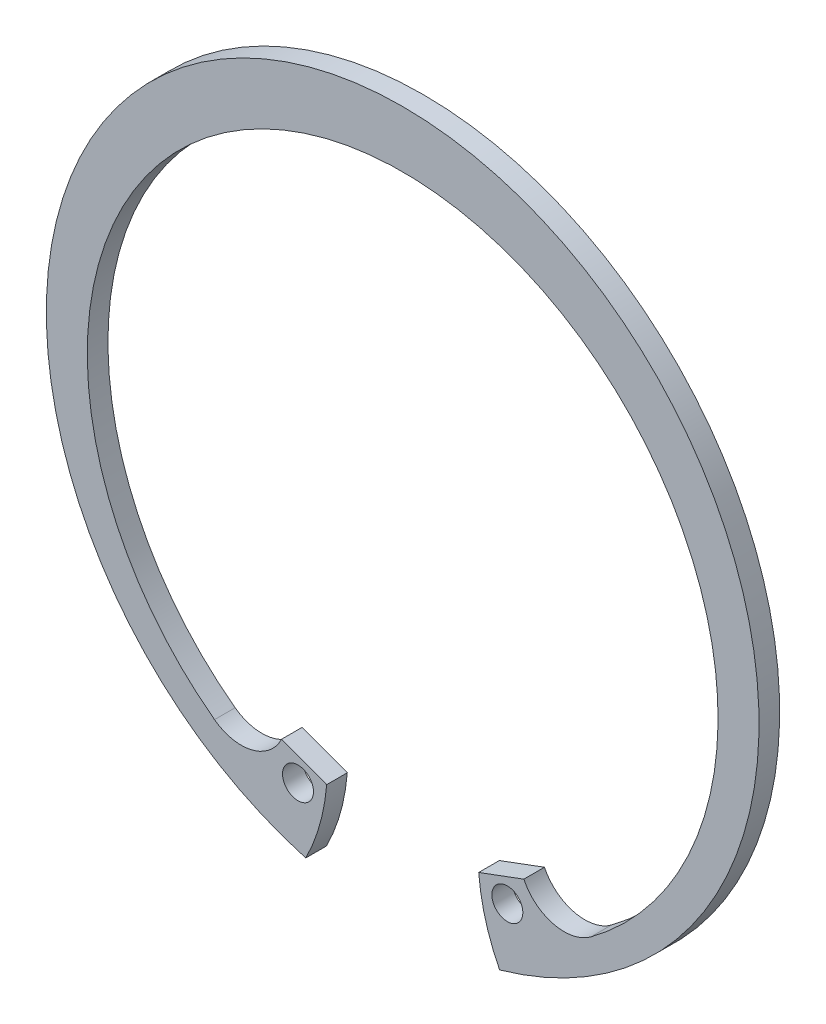
ISO-10303-21;
HEADER;
FILE_DESCRIPTION(('STEP AP214'),'2;1');
FILE_NAME('part.step','',(''),(''),'','','');
FILE_SCHEMA(('AUTOMOTIVE_DESIGN { 1 0 10303 214 1 1 1 1 }'));
ENDSEC;
DATA;
#1=APPLICATION_CONTEXT('core data for automotive mechanical design processes');
#2=APPLICATION_PROTOCOL_DEFINITION('international standard','automotive_design',2000,#1);
#3=PRODUCT_CONTEXT('',#1,'mechanical');
#4=PRODUCT('Part','Part','',(#3));
#5=PRODUCT_RELATED_PRODUCT_CATEGORY('part','',(#4));
#6=PRODUCT_DEFINITION_FORMATION('','',#4);
#7=PRODUCT_DEFINITION_CONTEXT('part definition',#1,'design');
#8=PRODUCT_DEFINITION('design','',#6,#7);
#9=PRODUCT_DEFINITION_SHAPE('','',#8);
#10=(LENGTH_UNIT() NAMED_UNIT(*) SI_UNIT(.MILLI.,.METRE.));
#11=(NAMED_UNIT(*) PLANE_ANGLE_UNIT() SI_UNIT($,.RADIAN.));
#12=(NAMED_UNIT(*) SI_UNIT($,.STERADIAN.) SOLID_ANGLE_UNIT());
#13=UNCERTAINTY_MEASURE_WITH_UNIT(LENGTH_MEASURE(1.E-05),#10,'distance_accuracy_value','');
#14=(GEOMETRIC_REPRESENTATION_CONTEXT(3) GLOBAL_UNCERTAINTY_ASSIGNED_CONTEXT((#13)) GLOBAL_UNIT_ASSIGNED_CONTEXT((#10,
#11,#12)) REPRESENTATION_CONTEXT('',''));
#15=CARTESIAN_POINT('',(0.,0.,0.));
#16=DIRECTION('',(0.,0.,1.));
#17=DIRECTION('',(1.,0.,0.));
#18=AXIS2_PLACEMENT_3D('',#15,#16,#17);
#19=CARTESIAN_POINT('',(0.,0.,-0.787399999999996));
#20=DIRECTION('',(0.,0.,1.));
#21=DIRECTION('',(1.,0.,0.));
#22=AXIS2_PLACEMENT_3D('',#19,#20,#21);
#23=CYLINDRICAL_SURFACE('',#22,27.1907);
#24=CARTESIAN_POINT('',(0.,0.,0.787400000000003));
#25=DIRECTION('',(0.,0.,1.));
#26=DIRECTION('',(-1.,0.,0.));
#27=AXIS2_PLACEMENT_3D('',#24,#25,#26);
#28=CIRCLE('',#27,27.1907);
#29=CARTESIAN_POINT('',(7.39561489525542,-26.1656080917504,0.787400000000003));
#30=VERTEX_POINT('',#29);
#31=CARTESIAN_POINT('',(-7.39561489525542,-26.1656080917504,0.787400000000003));
#32=VERTEX_POINT('',#31);
#33=EDGE_CURVE('E159',#30,#32,#28,.T.);
#34=ORIENTED_EDGE('',*,*,#33,.F.);
#35=DIRECTION('',(0.,0.,1.));
#36=VECTOR('',#35,1.);
#37=CARTESIAN_POINT('',(7.39561489525542,-26.1656080917504,-0.787399999999996));
#38=LINE('',#37,#36);
#39=CARTESIAN_POINT('',(7.39561489525542,-26.1656080917504,-0.787399999999996));
#40=VERTEX_POINT('',#39);
#41=EDGE_CURVE('E99',#40,#30,#38,.T.);
#42=ORIENTED_EDGE('',*,*,#41,.F.);
#43=CARTESIAN_POINT('',(0.,0.,-0.787399999999996));
#44=DIRECTION('',(0.,0.,1.));
#45=DIRECTION('',(-1.,0.,0.));
#46=AXIS2_PLACEMENT_3D('',#43,#44,#45);
#47=CIRCLE('',#46,27.1907);
#48=CARTESIAN_POINT('',(-7.39561489525542,-26.1656080917504,-0.787399999999996));
#49=VERTEX_POINT('',#48);
#50=EDGE_CURVE('E123',#40,#49,#47,.T.);
#51=ORIENTED_EDGE('',*,*,#50,.T.);
#52=DIRECTION('',(0.,0.,1.));
#53=VECTOR('',#52,1.);
#54=CARTESIAN_POINT('',(-7.39561489525542,-26.1656080917504,-0.787399999999996));
#55=LINE('',#54,#53);
#56=EDGE_CURVE('E170',#49,#32,#55,.T.);
#57=ORIENTED_EDGE('',*,*,#56,.T.);
#58=EDGE_LOOP('',(#34,#42,#51,#57));
#59=FACE_BOUND('',#58,.T.);
#60=ADVANCED_FACE('F32',(#59),#23,.T.);
#61=CARTESIAN_POINT('',(5.56259999999999,-20.6112705316776,-0.787399999999996));
#62=DIRECTION('',(-0.348262046442481,0.937397219436721,0.));
#63=DIRECTION('',(-0.937397219436721,-0.348262046442481,0.));
#64=AXIS2_PLACEMENT_3D('',#61,#62,#63);
#65=PLANE('',#64);
#66=DIRECTION('',(-0.93739721943672,-0.348262046442481,0.));
#67=VECTOR('',#66,1.);
#68=CARTESIAN_POINT('',(5.56259999999999,-20.6112705316776,-0.787399999999996));
#69=LINE('',#68,#67);
#70=CARTESIAN_POINT('',(9.24424160711762,-19.2434661326705,-0.787399999999996));
#71=VERTEX_POINT('',#70);
#72=CARTESIAN_POINT('',(5.80069889373692,-20.5228119718812,-0.787399999999996));
#73=VERTEX_POINT('',#72);
#74=EDGE_CURVE('E104',#71,#73,#69,.T.);
#75=ORIENTED_EDGE('',*,*,#74,.T.);
#76=DIRECTION('',(0.,0.,1.));
#77=VECTOR('',#76,1.);
#78=CARTESIAN_POINT('',(5.80069889373692,-20.5228119718812,-0.787399999999996));
#79=LINE('',#78,#77);
#80=CARTESIAN_POINT('',(5.80069889373692,-20.5228119718812,0.787400000000003));
#81=VERTEX_POINT('',#80);
#82=EDGE_CURVE('E97',#73,#81,#79,.T.);
#83=ORIENTED_EDGE('',*,*,#82,.T.);
#84=DIRECTION('',(-0.93739721943672,-0.348262046442481,0.));
#85=VECTOR('',#84,1.);
#86=CARTESIAN_POINT('',(5.56259999999999,-20.6112705316776,0.787400000000003));
#87=LINE('',#86,#85);
#88=CARTESIAN_POINT('',(9.24424160711762,-19.2434661326705,0.787400000000003));
#89=VERTEX_POINT('',#88);
#90=EDGE_CURVE('E103',#89,#81,#87,.T.);
#91=ORIENTED_EDGE('',*,*,#90,.F.);
#92=DIRECTION('',(0.,0.,1.));
#93=VECTOR('',#92,1.);
#94=CARTESIAN_POINT('',(9.24424160711762,-19.2434661326705,-0.787399999999996));
#95=LINE('',#94,#93);
#96=EDGE_CURVE('E53',#71,#89,#95,.T.);
#97=ORIENTED_EDGE('',*,*,#96,.F.);
#98=EDGE_LOOP('',(#75,#83,#91,#97));
#99=FACE_BOUND('',#98,.T.);
#100=ADVANCED_FACE('F102',(#99),#65,.T.);
#101=CARTESIAN_POINT('',(0.,0.,-0.787399999999996));
#102=DIRECTION('',(0.,0.,-1.));
#103=DIRECTION('',(-1.,0.,0.));
#104=AXIS2_PLACEMENT_3D('',#101,#102,#103);
#105=PLANE('',#104);
#106=CARTESIAN_POINT('',(7.98642189191705,-21.4965993314694,-0.787399999999996));
#107=DIRECTION('',(0.,0.,1.));
#108=DIRECTION('',(-1.,0.,0.));
#109=AXIS2_PLACEMENT_3D('',#106,#107,#108);
#110=CIRCLE('',#109,1.1811);
#111=CARTESIAN_POINT('',(6.80532189191705,-21.4965993314694,-0.787399999999996));
#112=VERTEX_POINT('',#111);
#113=EDGE_CURVE('E112',#112,#112,#110,.T.);
#114=ORIENTED_EDGE('',*,*,#113,.T.);
#115=EDGE_LOOP('',(#114));
#116=FACE_BOUND('',#115,.T.);
#117=CARTESIAN_POINT('',(-7.98642189191705,-21.4965993314694,-0.787399999999996));
#118=DIRECTION('',(0.,0.,1.));
#119=DIRECTION('',(1.,0.,0.));
#120=AXIS2_PLACEMENT_3D('',#117,#118,#119);
#121=CIRCLE('',#120,1.1811);
#122=CARTESIAN_POINT('',(-6.80532189191705,-21.4965993314694,-0.787399999999996));
#123=VERTEX_POINT('',#122);
#124=EDGE_CURVE('E115',#123,#123,#121,.T.);
#125=ORIENTED_EDGE('',*,*,#124,.T.);
#126=EDGE_LOOP('',(#125));
#127=FACE_BOUND('',#126,.T.);
#128=ORIENTED_EDGE('',*,*,#50,.F.);
#129=CARTESIAN_POINT('',(20.889256185816,-19.3048822845741,-0.787399999999996));
#130=DIRECTION('',(0.,0.,1.));
#131=DIRECTION('',(1.,0.,0.));
#132=AXIS2_PLACEMENT_3D('',#129,#130,#131);
#133=CIRCLE('',#132,15.1376323736434);
#134=EDGE_CURVE('E105',#73,#40,#133,.T.);
#135=ORIENTED_EDGE('',*,*,#134,.F.);
#136=ORIENTED_EDGE('',*,*,#74,.F.);
#137=CARTESIAN_POINT('',(12.3210689523703,-17.7654093643727,-0.787399999999996));
#138=DIRECTION('',(0.,0.,-1.));
#139=DIRECTION('',(-1.,0.,0.));
#140=AXIS2_PLACEMENT_3D('',#137,#138,#139);
#141=CIRCLE('',#140,3.41343204455658);
#142=CARTESIAN_POINT('',(14.3575932818083,-20.5047682270289,-0.787399999999996));
#143=VERTEX_POINT('',#142);
#144=EDGE_CURVE('E133',#143,#71,#141,.T.);
#145=ORIENTED_EDGE('',*,*,#144,.F.);
#146=CARTESIAN_POINT('',(0.,-1.1921580929838,-0.787399999999996));
#147=DIRECTION('',(0.,0.,-1.));
#148=DIRECTION('',(-1.,0.,0.));
#149=AXIS2_PLACEMENT_3D('',#146,#147,#148);
#150=CIRCLE('',#149,24.0648580929838);
#151=CARTESIAN_POINT('',(-14.3575932818084,-20.5047682270288,-0.787399999999996));
#152=VERTEX_POINT('',#151);
#153=EDGE_CURVE('E130',#152,#143,#150,.T.);
#154=ORIENTED_EDGE('',*,*,#153,.F.);
#155=CARTESIAN_POINT('',(-12.3210689523703,-17.7654093643727,-0.787399999999996));
#156=DIRECTION('',(0.,0.,-1.));
#157=DIRECTION('',(1.,0.,0.));
#158=AXIS2_PLACEMENT_3D('',#155,#156,#157);
#159=CIRCLE('',#158,3.41343204455658);
#160=CARTESIAN_POINT('',(-9.24424160711762,-19.2434661326705,-0.787399999999996));
#161=VERTEX_POINT('',#160);
#162=EDGE_CURVE('E127',#161,#152,#159,.T.);
#163=ORIENTED_EDGE('',*,*,#162,.F.);
#164=DIRECTION('',(-0.93739721943672,0.348262046442481,0.));
#165=VECTOR('',#164,1.);
#166=CARTESIAN_POINT('',(-5.56259999999999,-20.6112705316776,-0.787399999999996));
#167=LINE('',#166,#165);
#168=CARTESIAN_POINT('',(-5.80069889373692,-20.5228119718812,-0.787399999999996));
#169=VERTEX_POINT('',#168);
#170=EDGE_CURVE('E125',#169,#161,#167,.T.);
#171=ORIENTED_EDGE('',*,*,#170,.F.);
#172=CARTESIAN_POINT('',(-20.889256185816,-19.3048822845741,-0.787399999999996));
#173=DIRECTION('',(0.,0.,-1.));
#174=DIRECTION('',(-1.,0.,0.));
#175=AXIS2_PLACEMENT_3D('',#172,#173,#174);
#176=CIRCLE('',#175,15.1376323736434);
#177=EDGE_CURVE('E173',#169,#49,#176,.T.);
#178=ORIENTED_EDGE('',*,*,#177,.T.);
#179=EDGE_LOOP('',(#128,#135,#136,#145,#154,#163,#171,#178));
#180=FACE_BOUND('',#179,.T.);
#181=ADVANCED_FACE('F182',(#116,#127,#180),#105,.T.);
#182=CARTESIAN_POINT('',(0.,0.,0.787400000000003));
#183=DIRECTION('',(0.,0.,-1.));
#184=DIRECTION('',(-1.,0.,0.));
#185=AXIS2_PLACEMENT_3D('',#182,#183,#184);
#186=PLANE('',#185);
#187=CARTESIAN_POINT('',(-7.98642189191705,-21.4965993314694,0.787400000000003));
#188=DIRECTION('',(0.,0.,1.));
#189=DIRECTION('',(1.,0.,0.));
#190=AXIS2_PLACEMENT_3D('',#187,#188,#189);
#191=CIRCLE('',#190,1.1811);
#192=CARTESIAN_POINT('',(-6.80532189191705,-21.4965993314694,0.787400000000003));
#193=VERTEX_POINT('',#192);
#194=EDGE_CURVE('E163',#193,#193,#191,.T.);
#195=ORIENTED_EDGE('',*,*,#194,.F.);
#196=EDGE_LOOP('',(#195));
#197=FACE_BOUND('',#196,.T.);
#198=CARTESIAN_POINT('',(7.98642189191705,-21.4965993314694,0.787400000000003));
#199=DIRECTION('',(0.,0.,1.));
#200=DIRECTION('',(-1.,0.,0.));
#201=AXIS2_PLACEMENT_3D('',#198,#199,#200);
#202=CIRCLE('',#201,1.1811);
#203=CARTESIAN_POINT('',(6.80532189191705,-21.4965993314694,0.787400000000003));
#204=VERTEX_POINT('',#203);
#205=EDGE_CURVE('E166',#204,#204,#202,.T.);
#206=ORIENTED_EDGE('',*,*,#205,.F.);
#207=EDGE_LOOP('',(#206));
#208=FACE_BOUND('',#207,.T.);
#209=CARTESIAN_POINT('',(20.889256185816,-19.3048822845741,0.787400000000003));
#210=DIRECTION('',(0.,0.,-1.));
#211=DIRECTION('',(-1.,0.,0.));
#212=AXIS2_PLACEMENT_3D('',#209,#210,#211);
#213=CIRCLE('',#212,15.1376323736434);
#214=EDGE_CURVE('E11',#30,#81,#213,.T.);
#215=ORIENTED_EDGE('',*,*,#214,.F.);
#216=ORIENTED_EDGE('',*,*,#33,.T.);
#217=CARTESIAN_POINT('',(-20.889256185816,-19.3048822845741,0.787400000000003));
#218=DIRECTION('',(0.,0.,-1.));
#219=DIRECTION('',(-1.,0.,0.));
#220=AXIS2_PLACEMENT_3D('',#217,#218,#219);
#221=CIRCLE('',#220,15.1376323736434);
#222=CARTESIAN_POINT('',(-5.80069889373691,-20.5228119718812,0.787400000000003));
#223=VERTEX_POINT('',#222);
#224=EDGE_CURVE('E39',#32,#223,#221,.F.);
#225=ORIENTED_EDGE('',*,*,#224,.T.);
#226=DIRECTION('',(-0.93739721943672,0.348262046442481,0.));
#227=VECTOR('',#226,1.);
#228=CARTESIAN_POINT('',(-5.56259999999999,-20.6112705316776,0.787400000000003));
#229=LINE('',#228,#227);
#230=CARTESIAN_POINT('',(-9.24424160711762,-19.2434661326705,0.787400000000003));
#231=VERTEX_POINT('',#230);
#232=EDGE_CURVE('E150',#223,#231,#229,.T.);
#233=ORIENTED_EDGE('',*,*,#232,.T.);
#234=CARTESIAN_POINT('',(-12.3210689523703,-17.7654093643727,0.787400000000003));
#235=DIRECTION('',(0.,0.,-1.));
#236=DIRECTION('',(1.,0.,0.));
#237=AXIS2_PLACEMENT_3D('',#234,#235,#236);
#238=CIRCLE('',#237,3.41343204455658);
#239=CARTESIAN_POINT('',(-14.3575932818084,-20.5047682270288,0.787400000000003));
#240=VERTEX_POINT('',#239);
#241=EDGE_CURVE('E155',#231,#240,#238,.T.);
#242=ORIENTED_EDGE('',*,*,#241,.T.);
#243=CARTESIAN_POINT('',(0.,-1.1921580929838,0.787400000000003));
#244=DIRECTION('',(0.,0.,-1.));
#245=DIRECTION('',(-1.,0.,0.));
#246=AXIS2_PLACEMENT_3D('',#243,#244,#245);
#247=CIRCLE('',#246,24.0648580929838);
#248=CARTESIAN_POINT('',(14.3575932818083,-20.5047682270289,0.787400000000003));
#249=VERTEX_POINT('',#248);
#250=EDGE_CURVE('E117',#240,#249,#247,.T.);
#251=ORIENTED_EDGE('',*,*,#250,.T.);
#252=CARTESIAN_POINT('',(12.3210689523703,-17.7654093643727,0.787400000000003));
#253=DIRECTION('',(0.,0.,-1.));
#254=DIRECTION('',(-1.,0.,0.));
#255=AXIS2_PLACEMENT_3D('',#252,#253,#254);
#256=CIRCLE('',#255,3.41343204455658);
#257=EDGE_CURVE('E111',#249,#89,#256,.T.);
#258=ORIENTED_EDGE('',*,*,#257,.T.);
#259=ORIENTED_EDGE('',*,*,#90,.T.);
#260=EDGE_LOOP('',(#215,#216,#225,#233,#242,#251,#258,#259));
#261=FACE_BOUND('',#260,.T.);
#262=ADVANCED_FACE('F108',(#197,#208,#261),#186,.F.);
#263=CARTESIAN_POINT('',(12.3210689523703,-17.7654093643727,-0.787399999999996));
#264=DIRECTION('',(0.,0.,1.));
#265=DIRECTION('',(1.,0.,0.));
#266=AXIS2_PLACEMENT_3D('',#263,#264,#265);
#267=CYLINDRICAL_SURFACE('',#266,3.41343204455658);
#268=ORIENTED_EDGE('',*,*,#96,.T.);
#269=ORIENTED_EDGE('',*,*,#257,.F.);
#270=DIRECTION('',(0.,0.,1.));
#271=VECTOR('',#270,1.);
#272=CARTESIAN_POINT('',(14.3575932818083,-20.5047682270289,-0.787399999999996));
#273=LINE('',#272,#271);
#274=EDGE_CURVE('E139',#143,#249,#273,.T.);
#275=ORIENTED_EDGE('',*,*,#274,.F.);
#276=ORIENTED_EDGE('',*,*,#144,.T.);
#277=EDGE_LOOP('',(#268,#269,#275,#276));
#278=FACE_BOUND('',#277,.T.);
#279=ADVANCED_FACE('F209',(#278),#267,.F.);
#280=CARTESIAN_POINT('',(0.,-1.1921580929838,-0.787399999999996));
#281=DIRECTION('',(0.,0.,1.));
#282=DIRECTION('',(1.,0.,0.));
#283=AXIS2_PLACEMENT_3D('',#280,#281,#282);
#284=CYLINDRICAL_SURFACE('',#283,24.0648580929838);
#285=ORIENTED_EDGE('',*,*,#274,.T.);
#286=ORIENTED_EDGE('',*,*,#250,.F.);
#287=DIRECTION('',(0.,0.,1.));
#288=VECTOR('',#287,1.);
#289=CARTESIAN_POINT('',(-14.3575932818084,-20.5047682270288,-0.787399999999996));
#290=LINE('',#289,#288);
#291=EDGE_CURVE('E141',#152,#240,#290,.T.);
#292=ORIENTED_EDGE('',*,*,#291,.F.);
#293=ORIENTED_EDGE('',*,*,#153,.T.);
#294=EDGE_LOOP('',(#285,#286,#292,#293));
#295=FACE_BOUND('',#294,.T.);
#296=ADVANCED_FACE('F212',(#295),#284,.F.);
#297=CARTESIAN_POINT('',(-12.3210689523703,-17.7654093643727,-0.787399999999996));
#298=DIRECTION('',(0.,0.,1.));
#299=DIRECTION('',(1.,0.,0.));
#300=AXIS2_PLACEMENT_3D('',#297,#298,#299);
#301=CYLINDRICAL_SURFACE('',#300,3.41343204455658);
#302=ORIENTED_EDGE('',*,*,#291,.T.);
#303=ORIENTED_EDGE('',*,*,#241,.F.);
#304=DIRECTION('',(0.,0.,1.));
#305=VECTOR('',#304,1.);
#306=CARTESIAN_POINT('',(-9.24424160711762,-19.2434661326705,-0.787399999999996));
#307=LINE('',#306,#305);
#308=EDGE_CURVE('E137',#161,#231,#307,.T.);
#309=ORIENTED_EDGE('',*,*,#308,.F.);
#310=ORIENTED_EDGE('',*,*,#162,.T.);
#311=EDGE_LOOP('',(#302,#303,#309,#310));
#312=FACE_BOUND('',#311,.T.);
#313=ADVANCED_FACE('F156',(#312),#301,.F.);
#314=CARTESIAN_POINT('',(-5.56259999999999,-20.6112705316776,-0.787399999999996));
#315=DIRECTION('',(0.348262046442481,0.937397219436721,0.));
#316=DIRECTION('',(-0.937397219436721,0.348262046442481,0.));
#317=AXIS2_PLACEMENT_3D('',#314,#315,#316);
#318=PLANE('',#317);
#319=DIRECTION('',(0.,0.,1.));
#320=VECTOR('',#319,1.);
#321=CARTESIAN_POINT('',(-5.80069889373692,-20.5228119718812,-0.787399999999996));
#322=LINE('',#321,#320);
#323=EDGE_CURVE('E169',#169,#223,#322,.T.);
#324=ORIENTED_EDGE('',*,*,#323,.F.);
#325=ORIENTED_EDGE('',*,*,#170,.T.);
#326=ORIENTED_EDGE('',*,*,#308,.T.);
#327=ORIENTED_EDGE('',*,*,#232,.F.);
#328=EDGE_LOOP('',(#324,#325,#326,#327));
#329=FACE_BOUND('',#328,.T.);
#330=ADVANCED_FACE('F149',(#329),#318,.T.);
#331=CARTESIAN_POINT('',(-7.98642189191705,-21.4965993314694,-0.787399999999996));
#332=DIRECTION('',(0.,0.,1.));
#333=DIRECTION('',(1.,0.,0.));
#334=AXIS2_PLACEMENT_3D('',#331,#332,#333);
#335=CYLINDRICAL_SURFACE('',#334,1.1811);
#336=ORIENTED_EDGE('',*,*,#124,.F.);
#337=EDGE_LOOP('',(#336));
#338=FACE_BOUND('',#337,.T.);
#339=ORIENTED_EDGE('',*,*,#194,.T.);
#340=EDGE_LOOP('',(#339));
#341=FACE_BOUND('',#340,.T.);
#342=ADVANCED_FACE('F193',(#338,#341),#335,.F.);
#343=CARTESIAN_POINT('',(7.98642189191705,-21.4965993314694,-0.787399999999996));
#344=DIRECTION('',(0.,0.,1.));
#345=DIRECTION('',(1.,0.,0.));
#346=AXIS2_PLACEMENT_3D('',#343,#344,#345);
#347=CYLINDRICAL_SURFACE('',#346,1.1811);
#348=ORIENTED_EDGE('',*,*,#113,.F.);
#349=EDGE_LOOP('',(#348));
#350=FACE_BOUND('',#349,.T.);
#351=ORIENTED_EDGE('',*,*,#205,.T.);
#352=EDGE_LOOP('',(#351));
#353=FACE_BOUND('',#352,.T.);
#354=ADVANCED_FACE('F186',(#350,#353),#347,.F.);
#355=CARTESIAN_POINT('',(-20.889256185816,-19.3048822845741,-0.787399999999996));
#356=DIRECTION('',(0.,0.,1.));
#357=DIRECTION('',(1.,0.,0.));
#358=AXIS2_PLACEMENT_3D('',#355,#356,#357);
#359=CYLINDRICAL_SURFACE('',#358,15.1376323736434);
#360=ORIENTED_EDGE('',*,*,#224,.F.);
#361=ORIENTED_EDGE('',*,*,#56,.F.);
#362=ORIENTED_EDGE('',*,*,#177,.F.);
#363=ORIENTED_EDGE('',*,*,#323,.T.);
#364=EDGE_LOOP('',(#360,#361,#362,#363));
#365=FACE_BOUND('',#364,.T.);
#366=ADVANCED_FACE('F184',(#365),#359,.T.);
#367=CARTESIAN_POINT('',(20.889256185816,-19.3048822845741,-0.787399999999996));
#368=DIRECTION('',(0.,0.,1.));
#369=DIRECTION('',(1.,0.,0.));
#370=AXIS2_PLACEMENT_3D('',#367,#368,#369);
#371=CYLINDRICAL_SURFACE('',#370,15.1376323736434);
#372=ORIENTED_EDGE('',*,*,#82,.F.);
#373=ORIENTED_EDGE('',*,*,#134,.T.);
#374=ORIENTED_EDGE('',*,*,#41,.T.);
#375=ORIENTED_EDGE('',*,*,#214,.T.);
#376=EDGE_LOOP('',(#372,#373,#374,#375));
#377=FACE_BOUND('',#376,.T.);
#378=ADVANCED_FACE('F96',(#377),#371,.T.);
#379=CLOSED_SHELL('',(#60,#100,#181,#262,#279,#296,#313,#330,#342,#354,#366,#378));
#380=MANIFOLD_SOLID_BREP('B2',#379);
#381=ADVANCED_BREP_SHAPE_REPRESENTATION('',(#18,#380),#14);
#382=SHAPE_DEFINITION_REPRESENTATION(#9,#381);
ENDSEC;
END-ISO-10303-21;
